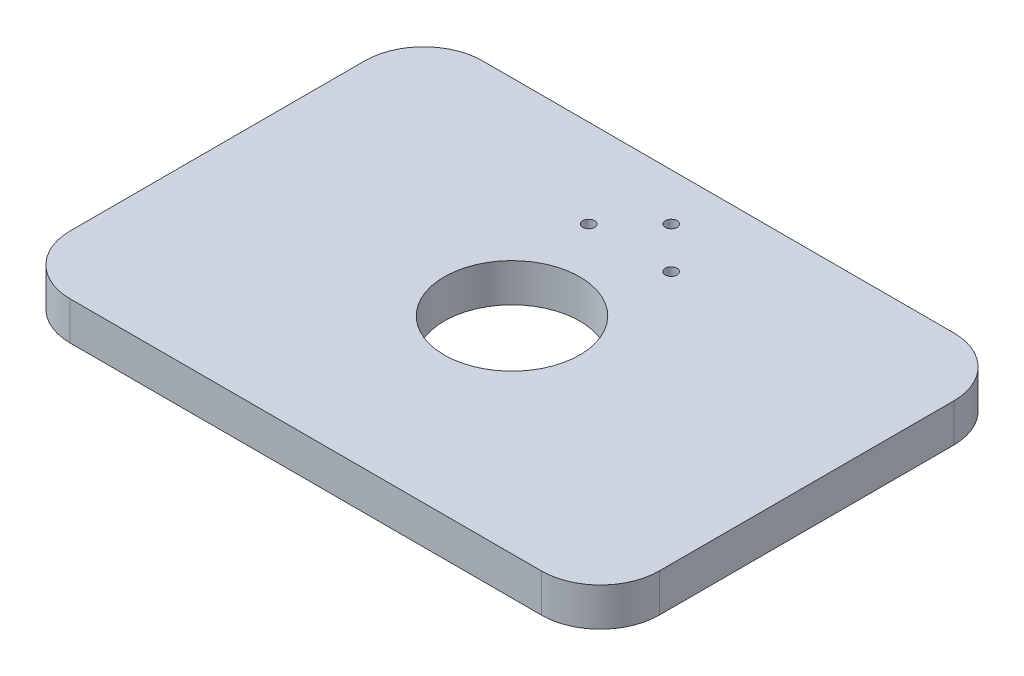
ISO-10303-21;
HEADER;
FILE_DESCRIPTION(('STEP AP214'),'2;1');
FILE_NAME('part.step','',(''),(''),'','','');
FILE_SCHEMA(('AUTOMOTIVE_DESIGN { 1 0 10303 214 1 1 1 1 }'));
ENDSEC;
DATA;
#1=APPLICATION_CONTEXT('core data for automotive mechanical design processes');
#2=APPLICATION_PROTOCOL_DEFINITION('international standard','automotive_design',2000,#1);
#3=PRODUCT_CONTEXT('',#1,'mechanical');
#4=PRODUCT('Part','Part','',(#3));
#5=PRODUCT_RELATED_PRODUCT_CATEGORY('part','',(#4));
#6=PRODUCT_DEFINITION_FORMATION('','',#4);
#7=PRODUCT_DEFINITION_CONTEXT('part definition',#1,'design');
#8=PRODUCT_DEFINITION('design','',#6,#7);
#9=PRODUCT_DEFINITION_SHAPE('','',#8);
#10=(LENGTH_UNIT() NAMED_UNIT(*) SI_UNIT(.MILLI.,.METRE.));
#11=(NAMED_UNIT(*) PLANE_ANGLE_UNIT() SI_UNIT($,.RADIAN.));
#12=(NAMED_UNIT(*) SI_UNIT($,.STERADIAN.) SOLID_ANGLE_UNIT());
#13=UNCERTAINTY_MEASURE_WITH_UNIT(LENGTH_MEASURE(1.E-05),#10,'distance_accuracy_value','');
#14=(GEOMETRIC_REPRESENTATION_CONTEXT(3) GLOBAL_UNCERTAINTY_ASSIGNED_CONTEXT((#13)) GLOBAL_UNIT_ASSIGNED_CONTEXT((#10,
#11,#12)) REPRESENTATION_CONTEXT('',''));
#15=CARTESIAN_POINT('',(0.,0.,0.));
#16=DIRECTION('',(0.,0.,1.));
#17=DIRECTION('',(1.,0.,0.));
#18=AXIS2_PLACEMENT_3D('',#15,#16,#17);
#19=CARTESIAN_POINT('',(-50.,6.5,35.));
#20=DIRECTION('',(1.,0.,0.));
#21=DIRECTION('',(0.,0.,-1.));
#22=AXIS2_PLACEMENT_3D('',#19,#20,#21);
#23=PLANE('',#22);
#24=DIRECTION('',(0.,0.,1.));
#25=VECTOR('',#24,1.);
#26=CARTESIAN_POINT('',(-50.,6.5,35.));
#27=LINE('',#26,#25);
#28=CARTESIAN_POINT('',(-50.,6.5,-25.));
#29=VERTEX_POINT('',#28);
#30=CARTESIAN_POINT('',(-50.,6.5,25.));
#31=VERTEX_POINT('',#30);
#32=EDGE_CURVE('E118',#29,#31,#27,.T.);
#33=ORIENTED_EDGE('',*,*,#32,.F.);
#34=DIRECTION('',(0.,-1.,0.));
#35=VECTOR('',#34,1.);
#36=CARTESIAN_POINT('',(-50.,6.5,-25.));
#37=LINE('',#36,#35);
#38=CARTESIAN_POINT('',(-50.,0.,-25.));
#39=VERTEX_POINT('',#38);
#40=EDGE_CURVE('E103',#29,#39,#37,.T.);
#41=ORIENTED_EDGE('',*,*,#40,.T.);
#42=DIRECTION('',(0.,0.,1.));
#43=VECTOR('',#42,1.);
#44=CARTESIAN_POINT('',(-50.,0.,35.));
#45=LINE('',#44,#43);
#46=CARTESIAN_POINT('',(-50.,0.,25.));
#47=VERTEX_POINT('',#46);
#48=EDGE_CURVE('E115',#39,#47,#45,.T.);
#49=ORIENTED_EDGE('',*,*,#48,.T.);
#50=DIRECTION('',(0.,-1.,0.));
#51=VECTOR('',#50,1.);
#52=CARTESIAN_POINT('',(-50.,6.5,25.));
#53=LINE('',#52,#51);
#54=EDGE_CURVE('E120',#47,#31,#53,.F.);
#55=ORIENTED_EDGE('',*,*,#54,.T.);
#56=EDGE_LOOP('',(#33,#41,#49,#55));
#57=FACE_BOUND('',#56,.T.);
#58=ADVANCED_FACE('F33',(#57),#23,.F.);
#59=CARTESIAN_POINT('',(50.,6.5,35.));
#60=DIRECTION('',(0.,0.,-1.));
#61=DIRECTION('',(-1.,0.,0.));
#62=AXIS2_PLACEMENT_3D('',#59,#60,#61);
#63=PLANE('',#62);
#64=DIRECTION('',(1.,0.,0.));
#65=VECTOR('',#64,1.);
#66=CARTESIAN_POINT('',(50.,6.5,35.));
#67=LINE('',#66,#65);
#68=CARTESIAN_POINT('',(-40.,6.5,35.));
#69=VERTEX_POINT('',#68);
#70=CARTESIAN_POINT('',(40.,6.5,35.));
#71=VERTEX_POINT('',#70);
#72=EDGE_CURVE('E174',#69,#71,#67,.T.);
#73=ORIENTED_EDGE('',*,*,#72,.F.);
#74=DIRECTION('',(0.,-1.,0.));
#75=VECTOR('',#74,1.);
#76=CARTESIAN_POINT('',(-40.,6.5,35.));
#77=LINE('',#76,#75);
#78=CARTESIAN_POINT('',(-40.,0.,35.));
#79=VERTEX_POINT('',#78);
#80=EDGE_CURVE('E167',#69,#79,#77,.T.);
#81=ORIENTED_EDGE('',*,*,#80,.T.);
#82=DIRECTION('',(1.,0.,0.));
#83=VECTOR('',#82,1.);
#84=CARTESIAN_POINT('',(50.,0.,35.));
#85=LINE('',#84,#83);
#86=CARTESIAN_POINT('',(40.,0.,35.));
#87=VERTEX_POINT('',#86);
#88=EDGE_CURVE('E124',#79,#87,#85,.T.);
#89=ORIENTED_EDGE('',*,*,#88,.T.);
#90=DIRECTION('',(0.,-1.,0.));
#91=VECTOR('',#90,1.);
#92=CARTESIAN_POINT('',(40.,6.5,35.));
#93=LINE('',#92,#91);
#94=EDGE_CURVE('E165',#87,#71,#93,.F.);
#95=ORIENTED_EDGE('',*,*,#94,.T.);
#96=EDGE_LOOP('',(#73,#81,#89,#95));
#97=FACE_BOUND('',#96,.T.);
#98=ADVANCED_FACE('F172',(#97),#63,.F.);
#99=CARTESIAN_POINT('',(50.,6.5,35.));
#100=DIRECTION('',(-1.,0.,0.));
#101=DIRECTION('',(0.,0.,1.));
#102=AXIS2_PLACEMENT_3D('',#99,#100,#101);
#103=PLANE('',#102);
#104=DIRECTION('',(0.,0.,-1.));
#105=VECTOR('',#104,1.);
#106=CARTESIAN_POINT('',(50.,6.5,35.));
#107=LINE('',#106,#105);
#108=CARTESIAN_POINT('',(50.,6.5,25.));
#109=VERTEX_POINT('',#108);
#110=CARTESIAN_POINT('',(50.,6.5,-25.));
#111=VERTEX_POINT('',#110);
#112=EDGE_CURVE('E182',#109,#111,#107,.T.);
#113=ORIENTED_EDGE('',*,*,#112,.F.);
#114=DIRECTION('',(0.,-1.,0.));
#115=VECTOR('',#114,1.);
#116=CARTESIAN_POINT('',(50.,6.5,25.));
#117=LINE('',#116,#115);
#118=CARTESIAN_POINT('',(50.,0.,25.));
#119=VERTEX_POINT('',#118);
#120=EDGE_CURVE('E11',#109,#119,#117,.T.);
#121=ORIENTED_EDGE('',*,*,#120,.T.);
#122=DIRECTION('',(0.,0.,-1.));
#123=VECTOR('',#122,1.);
#124=CARTESIAN_POINT('',(50.,0.,35.));
#125=LINE('',#124,#123);
#126=CARTESIAN_POINT('',(50.,0.,-25.));
#127=VERTEX_POINT('',#126);
#128=EDGE_CURVE('E128',#119,#127,#125,.T.);
#129=ORIENTED_EDGE('',*,*,#128,.T.);
#130=DIRECTION('',(0.,-1.,0.));
#131=VECTOR('',#130,1.);
#132=CARTESIAN_POINT('',(50.,6.5,-25.));
#133=LINE('',#132,#131);
#134=EDGE_CURVE('E41',#127,#111,#133,.F.);
#135=ORIENTED_EDGE('',*,*,#134,.T.);
#136=EDGE_LOOP('',(#113,#121,#129,#135));
#137=FACE_BOUND('',#136,.T.);
#138=ADVANCED_FACE('F181',(#137),#103,.F.);
#139=CARTESIAN_POINT('',(50.,6.5,-35.));
#140=DIRECTION('',(0.,0.,1.));
#141=DIRECTION('',(1.,0.,0.));
#142=AXIS2_PLACEMENT_3D('',#139,#140,#141);
#143=PLANE('',#142);
#144=DIRECTION('',(-1.,0.,0.));
#145=VECTOR('',#144,1.);
#146=CARTESIAN_POINT('',(50.,0.,-35.));
#147=LINE('',#146,#145);
#148=CARTESIAN_POINT('',(40.,0.,-35.));
#149=VERTEX_POINT('',#148);
#150=CARTESIAN_POINT('',(-40.,0.,-35.));
#151=VERTEX_POINT('',#150);
#152=EDGE_CURVE('E138',#149,#151,#147,.T.);
#153=ORIENTED_EDGE('',*,*,#152,.T.);
#154=DIRECTION('',(0.,-1.,0.));
#155=VECTOR('',#154,1.);
#156=CARTESIAN_POINT('',(-40.,6.5,-35.));
#157=LINE('',#156,#155);
#158=CARTESIAN_POINT('',(-40.,6.5,-35.));
#159=VERTEX_POINT('',#158);
#160=EDGE_CURVE('E104',#151,#159,#157,.F.);
#161=ORIENTED_EDGE('',*,*,#160,.T.);
#162=DIRECTION('',(-1.,0.,0.));
#163=VECTOR('',#162,1.);
#164=CARTESIAN_POINT('',(50.,6.5,-35.));
#165=LINE('',#164,#163);
#166=CARTESIAN_POINT('',(40.,6.5,-35.));
#167=VERTEX_POINT('',#166);
#168=EDGE_CURVE('E134',#167,#159,#165,.T.);
#169=ORIENTED_EDGE('',*,*,#168,.F.);
#170=DIRECTION('',(0.,-1.,0.));
#171=VECTOR('',#170,1.);
#172=CARTESIAN_POINT('',(40.,6.5,-35.));
#173=LINE('',#172,#171);
#174=EDGE_CURVE('E109',#167,#149,#173,.T.);
#175=ORIENTED_EDGE('',*,*,#174,.T.);
#176=EDGE_LOOP('',(#153,#161,#169,#175));
#177=FACE_BOUND('',#176,.T.);
#178=ADVANCED_FACE('F251',(#177),#143,.F.);
#179=CARTESIAN_POINT('',(0.,6.5,0.));
#180=DIRECTION('',(0.,1.,0.));
#181=DIRECTION('',(0.,0.,1.));
#182=AXIS2_PLACEMENT_3D('',#179,#180,#181);
#183=PLANE('',#182);
#184=CARTESIAN_POINT('',(-7.00000000000034,6.49999999999857,-20.0199999999996));
#185=DIRECTION('',(0.,-1.,0.));
#186=DIRECTION('',(0.,0.,-1.));
#187=AXIS2_PLACEMENT_3D('',#184,#185,#186);
#188=CIRCLE('',#187,0.990000000000501);
#189=CARTESIAN_POINT('',(-7.00000000000034,6.49999999999857,-21.0100000000001));
#190=VERTEX_POINT('',#189);
#191=EDGE_CURVE('E144',#190,#190,#188,.T.);
#192=ORIENTED_EDGE('',*,*,#191,.T.);
#193=EDGE_LOOP('',(#192));
#194=FACE_BOUND('',#193,.T.);
#195=CARTESIAN_POINT('',(-3.38271077815477E-13,6.49999999999857,-27.0199999999996));
#196=DIRECTION('',(0.,-1.,0.));
#197=DIRECTION('',(0.,0.,-1.));
#198=AXIS2_PLACEMENT_3D('',#195,#196,#197);
#199=CIRCLE('',#198,1.);
#200=CARTESIAN_POINT('',(-3.38271077815477E-13,6.49999999999857,-28.0199999999996));
#201=VERTEX_POINT('',#200);
#202=EDGE_CURVE('E193',#201,#201,#199,.T.);
#203=ORIENTED_EDGE('',*,*,#202,.T.);
#204=EDGE_LOOP('',(#203));
#205=FACE_BOUND('',#204,.T.);
#206=CARTESIAN_POINT('',(6.99999999999966,6.49999999999857,-20.0199999999996));
#207=DIRECTION('',(0.,-1.,0.));
#208=DIRECTION('',(0.,0.,-1.));
#209=AXIS2_PLACEMENT_3D('',#206,#207,#208);
#210=CIRCLE('',#209,1.);
#211=CARTESIAN_POINT('',(6.99999999999966,6.49999999999857,-21.0199999999996));
#212=VERTEX_POINT('',#211);
#213=EDGE_CURVE('E190',#212,#212,#210,.T.);
#214=ORIENTED_EDGE('',*,*,#213,.T.);
#215=EDGE_LOOP('',(#214));
#216=FACE_BOUND('',#215,.T.);
#217=CARTESIAN_POINT('',(-3.40005801291454E-13,6.49999999999999,4.06792655116561E-13));
#218=DIRECTION('',(0.,1.,0.));
#219=DIRECTION('',(0.,0.,1.));
#220=AXIS2_PLACEMENT_3D('',#217,#218,#219);
#221=CIRCLE('',#220,11.5);
#222=CARTESIAN_POINT('',(-3.40005801291454E-13,6.49999999999999,11.5000000000004));
#223=VERTEX_POINT('',#222);
#224=EDGE_CURVE('E131',#223,#223,#221,.T.);
#225=ORIENTED_EDGE('',*,*,#224,.F.);
#226=EDGE_LOOP('',(#225));
#227=FACE_BOUND('',#226,.T.);
#228=ORIENTED_EDGE('',*,*,#168,.T.);
#229=CARTESIAN_POINT('',(-40.,6.5,-25.));
#230=DIRECTION('',(0.,1.,0.));
#231=DIRECTION('',(0.,0.,1.));
#232=AXIS2_PLACEMENT_3D('',#229,#230,#231);
#233=CIRCLE('',#232,10.);
#234=EDGE_CURVE('E163',#159,#29,#233,.T.);
#235=ORIENTED_EDGE('',*,*,#234,.T.);
#236=ORIENTED_EDGE('',*,*,#32,.T.);
#237=CARTESIAN_POINT('',(-40.,6.5,25.));
#238=DIRECTION('',(0.,1.,0.));
#239=DIRECTION('',(0.,0.,1.));
#240=AXIS2_PLACEMENT_3D('',#237,#238,#239);
#241=CIRCLE('',#240,10.);
#242=EDGE_CURVE('E161',#31,#69,#241,.T.);
#243=ORIENTED_EDGE('',*,*,#242,.T.);
#244=ORIENTED_EDGE('',*,*,#72,.T.);
#245=CARTESIAN_POINT('',(40.,6.5,25.));
#246=DIRECTION('',(0.,1.,0.));
#247=DIRECTION('',(0.,0.,1.));
#248=AXIS2_PLACEMENT_3D('',#245,#246,#247);
#249=CIRCLE('',#248,10.);
#250=EDGE_CURVE('E54',#71,#109,#249,.T.);
#251=ORIENTED_EDGE('',*,*,#250,.T.);
#252=ORIENTED_EDGE('',*,*,#112,.T.);
#253=CARTESIAN_POINT('',(40.,6.5,-25.));
#254=DIRECTION('',(0.,1.,0.));
#255=DIRECTION('',(0.,0.,1.));
#256=AXIS2_PLACEMENT_3D('',#253,#254,#255);
#257=CIRCLE('',#256,10.);
#258=EDGE_CURVE('E158',#111,#167,#257,.T.);
#259=ORIENTED_EDGE('',*,*,#258,.T.);
#260=EDGE_LOOP('',(#228,#235,#236,#243,#244,#251,#252,#259));
#261=FACE_BOUND('',#260,.T.);
#262=ADVANCED_FACE('F199',(#194,#205,#216,#227,#261),#183,.T.);
#263=CARTESIAN_POINT('',(0.,0.,0.));
#264=DIRECTION('',(0.,1.,0.));
#265=DIRECTION('',(0.,0.,1.));
#266=AXIS2_PLACEMENT_3D('',#263,#264,#265);
#267=PLANE('',#266);
#268=CARTESIAN_POINT('',(-7.00000000000034,0.,-20.0199999999996));
#269=DIRECTION('',(0.,1.,0.));
#270=DIRECTION('',(0.,0.,1.));
#271=AXIS2_PLACEMENT_3D('',#268,#269,#270);
#272=CIRCLE('',#271,0.990000000000501);
#273=CARTESIAN_POINT('',(-7.00000000000034,0.,-19.0299999999991));
#274=VERTEX_POINT('',#273);
#275=EDGE_CURVE('E147',#274,#274,#272,.F.);
#276=ORIENTED_EDGE('',*,*,#275,.F.);
#277=EDGE_LOOP('',(#276));
#278=FACE_BOUND('',#277,.T.);
#279=CARTESIAN_POINT('',(-3.38378701082882E-13,0.,-27.0199999999996));
#280=DIRECTION('',(0.,1.,0.));
#281=DIRECTION('',(0.,0.,1.));
#282=AXIS2_PLACEMENT_3D('',#279,#280,#281);
#283=CIRCLE('',#282,1.);
#284=CARTESIAN_POINT('',(-3.38378701082882E-13,0.,-26.0199999999996));
#285=VERTEX_POINT('',#284);
#286=EDGE_CURVE('E143',#285,#285,#283,.F.);
#287=ORIENTED_EDGE('',*,*,#286,.F.);
#288=EDGE_LOOP('',(#287));
#289=FACE_BOUND('',#288,.T.);
#290=CARTESIAN_POINT('',(6.99999999999966,0.,-20.0199999999996));
#291=DIRECTION('',(0.,1.,0.));
#292=DIRECTION('',(0.,0.,1.));
#293=AXIS2_PLACEMENT_3D('',#290,#291,#292);
#294=CIRCLE('',#293,1.);
#295=CARTESIAN_POINT('',(6.99999999999966,0.,-19.0199999999996));
#296=VERTEX_POINT('',#295);
#297=EDGE_CURVE('E140',#296,#296,#294,.F.);
#298=ORIENTED_EDGE('',*,*,#297,.F.);
#299=EDGE_LOOP('',(#298));
#300=FACE_BOUND('',#299,.T.);
#301=CARTESIAN_POINT('',(-3.40005801291454E-13,0.,4.06792655116561E-13));
#302=DIRECTION('',(0.,1.,0.));
#303=DIRECTION('',(0.,0.,1.));
#304=AXIS2_PLACEMENT_3D('',#301,#302,#303);
#305=CIRCLE('',#304,11.5);
#306=CARTESIAN_POINT('',(-3.40005801291454E-13,0.,11.5000000000004));
#307=VERTEX_POINT('',#306);
#308=EDGE_CURVE('E125',#307,#307,#305,.T.);
#309=ORIENTED_EDGE('',*,*,#308,.T.);
#310=EDGE_LOOP('',(#309));
#311=FACE_BOUND('',#310,.T.);
#312=ORIENTED_EDGE('',*,*,#48,.F.);
#313=CARTESIAN_POINT('',(-40.,0.,-25.));
#314=DIRECTION('',(0.,1.,0.));
#315=DIRECTION('',(0.,0.,1.));
#316=AXIS2_PLACEMENT_3D('',#313,#314,#315);
#317=CIRCLE('',#316,10.);
#318=EDGE_CURVE('E99',#39,#151,#317,.F.);
#319=ORIENTED_EDGE('',*,*,#318,.T.);
#320=ORIENTED_EDGE('',*,*,#152,.F.);
#321=CARTESIAN_POINT('',(40.,0.,-25.));
#322=DIRECTION('',(0.,1.,0.));
#323=DIRECTION('',(0.,0.,1.));
#324=AXIS2_PLACEMENT_3D('',#321,#322,#323);
#325=CIRCLE('',#324,10.);
#326=EDGE_CURVE('E119',#149,#127,#325,.F.);
#327=ORIENTED_EDGE('',*,*,#326,.T.);
#328=ORIENTED_EDGE('',*,*,#128,.F.);
#329=CARTESIAN_POINT('',(40.,0.,25.));
#330=DIRECTION('',(0.,1.,0.));
#331=DIRECTION('',(0.,0.,1.));
#332=AXIS2_PLACEMENT_3D('',#329,#330,#331);
#333=CIRCLE('',#332,10.);
#334=EDGE_CURVE('E152',#119,#87,#333,.F.);
#335=ORIENTED_EDGE('',*,*,#334,.T.);
#336=ORIENTED_EDGE('',*,*,#88,.F.);
#337=CARTESIAN_POINT('',(-40.,0.,25.));
#338=DIRECTION('',(0.,1.,0.));
#339=DIRECTION('',(0.,0.,1.));
#340=AXIS2_PLACEMENT_3D('',#337,#338,#339);
#341=CIRCLE('',#340,10.);
#342=EDGE_CURVE('E110',#79,#47,#341,.F.);
#343=ORIENTED_EDGE('',*,*,#342,.T.);
#344=EDGE_LOOP('',(#312,#319,#320,#327,#328,#335,#336,#343));
#345=FACE_BOUND('',#344,.T.);
#346=ADVANCED_FACE('F122',(#278,#289,#300,#311,#345),#267,.F.);
#347=CARTESIAN_POINT('',(-3.40005801291454E-13,-12.5,4.06792655116561E-13));
#348=DIRECTION('',(0.,1.,0.));
#349=DIRECTION('',(0.,0.,1.));
#350=AXIS2_PLACEMENT_3D('',#347,#348,#349);
#351=CYLINDRICAL_SURFACE('',#350,11.5);
#352=ORIENTED_EDGE('',*,*,#224,.T.);
#353=EDGE_LOOP('',(#352));
#354=FACE_BOUND('',#353,.T.);
#355=ORIENTED_EDGE('',*,*,#308,.F.);
#356=EDGE_LOOP('',(#355));
#357=FACE_BOUND('',#356,.T.);
#358=ADVANCED_FACE('F211',(#354,#357),#351,.F.);
#359=CARTESIAN_POINT('',(6.99999999999966,-1.50000000000142,-20.0199999999996));
#360=DIRECTION('',(0.,1.,0.));
#361=DIRECTION('',(0.,0.,1.));
#362=AXIS2_PLACEMENT_3D('',#359,#360,#361);
#363=CYLINDRICAL_SURFACE('',#362,1.);
#364=ORIENTED_EDGE('',*,*,#213,.F.);
#365=EDGE_LOOP('',(#364));
#366=FACE_BOUND('',#365,.T.);
#367=ORIENTED_EDGE('',*,*,#297,.T.);
#368=EDGE_LOOP('',(#367));
#369=FACE_BOUND('',#368,.T.);
#370=ADVANCED_FACE('F220',(#366,#369),#363,.F.);
#371=CARTESIAN_POINT('',(-3.38403537221514E-13,-1.50000000000142,-27.0199999999996));
#372=DIRECTION('',(0.,1.,0.));
#373=DIRECTION('',(0.,0.,1.));
#374=AXIS2_PLACEMENT_3D('',#371,#372,#373);
#375=CYLINDRICAL_SURFACE('',#374,1.);
#376=ORIENTED_EDGE('',*,*,#202,.F.);
#377=EDGE_LOOP('',(#376));
#378=FACE_BOUND('',#377,.T.);
#379=ORIENTED_EDGE('',*,*,#286,.T.);
#380=EDGE_LOOP('',(#379));
#381=FACE_BOUND('',#380,.T.);
#382=ADVANCED_FACE('F205',(#378,#381),#375,.F.);
#383=CARTESIAN_POINT('',(-7.00000000000034,-1.50000000000142,-20.0199999999996));
#384=DIRECTION('',(0.,1.,0.));
#385=DIRECTION('',(0.,0.,1.));
#386=AXIS2_PLACEMENT_3D('',#383,#384,#385);
#387=CYLINDRICAL_SURFACE('',#386,0.990000000000501);
#388=ORIENTED_EDGE('',*,*,#191,.F.);
#389=EDGE_LOOP('',(#388));
#390=FACE_BOUND('',#389,.T.);
#391=ORIENTED_EDGE('',*,*,#275,.T.);
#392=EDGE_LOOP('',(#391));
#393=FACE_BOUND('',#392,.T.);
#394=ADVANCED_FACE('F202',(#390,#393),#387,.F.);
#395=CARTESIAN_POINT('',(-40.,6.5,-25.));
#396=DIRECTION('',(0.,-1.,0.));
#397=DIRECTION('',(0.,0.,-1.));
#398=AXIS2_PLACEMENT_3D('',#395,#396,#397);
#399=CYLINDRICAL_SURFACE('',#398,10.);
#400=ORIENTED_EDGE('',*,*,#234,.F.);
#401=ORIENTED_EDGE('',*,*,#160,.F.);
#402=ORIENTED_EDGE('',*,*,#318,.F.);
#403=ORIENTED_EDGE('',*,*,#40,.F.);
#404=EDGE_LOOP('',(#400,#401,#402,#403));
#405=FACE_BOUND('',#404,.T.);
#406=ADVANCED_FACE('F102',(#405),#399,.T.);
#407=CARTESIAN_POINT('',(-40.,6.5,25.));
#408=DIRECTION('',(0.,-1.,0.));
#409=DIRECTION('',(0.,0.,-1.));
#410=AXIS2_PLACEMENT_3D('',#407,#408,#409);
#411=CYLINDRICAL_SURFACE('',#410,10.);
#412=ORIENTED_EDGE('',*,*,#242,.F.);
#413=ORIENTED_EDGE('',*,*,#54,.F.);
#414=ORIENTED_EDGE('',*,*,#342,.F.);
#415=ORIENTED_EDGE('',*,*,#80,.F.);
#416=EDGE_LOOP('',(#412,#413,#414,#415));
#417=FACE_BOUND('',#416,.T.);
#418=ADVANCED_FACE('F239',(#417),#411,.T.);
#419=CARTESIAN_POINT('',(40.,6.5,25.));
#420=DIRECTION('',(0.,-1.,0.));
#421=DIRECTION('',(0.,0.,-1.));
#422=AXIS2_PLACEMENT_3D('',#419,#420,#421);
#423=CYLINDRICAL_SURFACE('',#422,10.);
#424=ORIENTED_EDGE('',*,*,#250,.F.);
#425=ORIENTED_EDGE('',*,*,#94,.F.);
#426=ORIENTED_EDGE('',*,*,#334,.F.);
#427=ORIENTED_EDGE('',*,*,#120,.F.);
#428=EDGE_LOOP('',(#424,#425,#426,#427));
#429=FACE_BOUND('',#428,.T.);
#430=ADVANCED_FACE('F180',(#429),#423,.T.);
#431=CARTESIAN_POINT('',(40.,6.5,-25.));
#432=DIRECTION('',(0.,-1.,0.));
#433=DIRECTION('',(0.,0.,-1.));
#434=AXIS2_PLACEMENT_3D('',#431,#432,#433);
#435=CYLINDRICAL_SURFACE('',#434,10.);
#436=ORIENTED_EDGE('',*,*,#258,.F.);
#437=ORIENTED_EDGE('',*,*,#134,.F.);
#438=ORIENTED_EDGE('',*,*,#326,.F.);
#439=ORIENTED_EDGE('',*,*,#174,.F.);
#440=EDGE_LOOP('',(#436,#437,#438,#439));
#441=FACE_BOUND('',#440,.T.);
#442=ADVANCED_FACE('F35',(#441),#435,.T.);
#443=CLOSED_SHELL('',(#58,#98,#138,#178,#262,#346,#358,#370,#382,#394,#406,#418,#430,#442));
#444=MANIFOLD_SOLID_BREP('B2',#443);
#445=ADVANCED_BREP_SHAPE_REPRESENTATION('',(#18,#444),#14);
#446=SHAPE_DEFINITION_REPRESENTATION(#9,#445);
ENDSEC;
END-ISO-10303-21;
